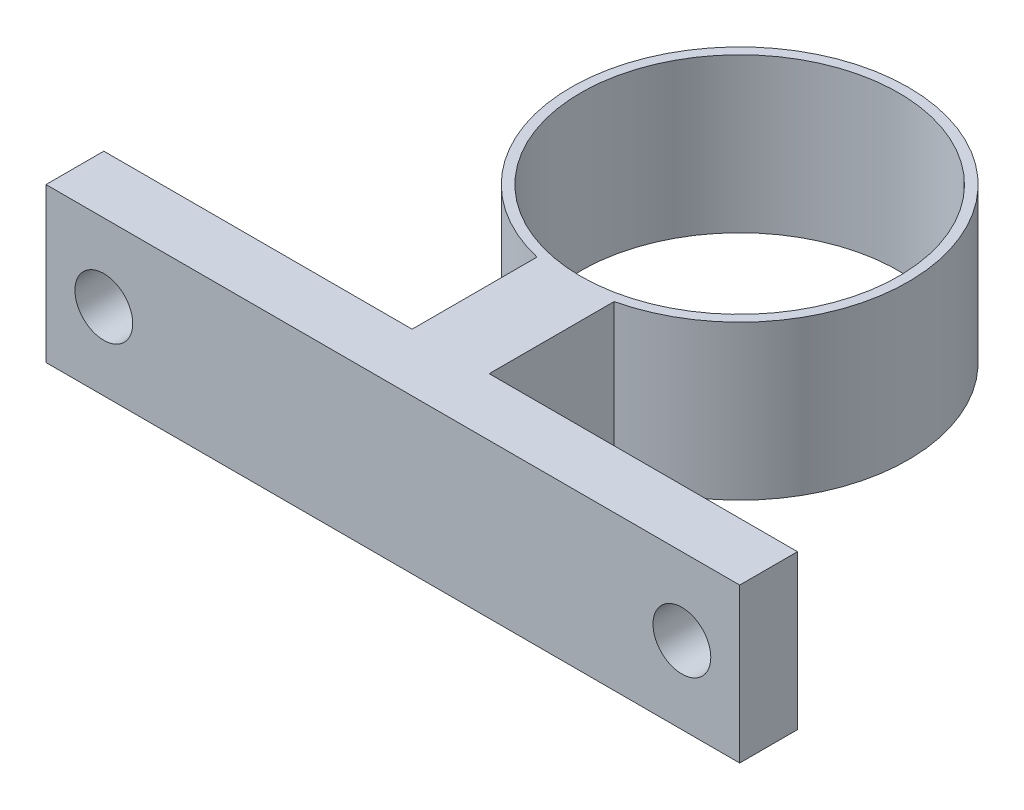
ISO-10303-21;
HEADER;
FILE_DESCRIPTION(('STEP AP214'),'2;1');
FILE_NAME('part.step','',(''),(''),'','','');
FILE_SCHEMA(('AUTOMOTIVE_DESIGN { 1 0 10303 214 1 1 1 1 }'));
ENDSEC;
DATA;
#1=APPLICATION_CONTEXT('core data for automotive mechanical design processes');
#2=APPLICATION_PROTOCOL_DEFINITION('international standard','automotive_design',2000,#1);
#3=PRODUCT_CONTEXT('',#1,'mechanical');
#4=PRODUCT('Part','Part','',(#3));
#5=PRODUCT_RELATED_PRODUCT_CATEGORY('part','',(#4));
#6=PRODUCT_DEFINITION_FORMATION('','',#4);
#7=PRODUCT_DEFINITION_CONTEXT('part definition',#1,'design');
#8=PRODUCT_DEFINITION('design','',#6,#7);
#9=PRODUCT_DEFINITION_SHAPE('','',#8);
#10=(LENGTH_UNIT() NAMED_UNIT(*) SI_UNIT(.MILLI.,.METRE.));
#11=(NAMED_UNIT(*) PLANE_ANGLE_UNIT() SI_UNIT($,.RADIAN.));
#12=(NAMED_UNIT(*) SI_UNIT($,.STERADIAN.) SOLID_ANGLE_UNIT());
#13=UNCERTAINTY_MEASURE_WITH_UNIT(LENGTH_MEASURE(1.E-05),#10,'distance_accuracy_value','');
#14=(GEOMETRIC_REPRESENTATION_CONTEXT(3) GLOBAL_UNCERTAINTY_ASSIGNED_CONTEXT((#13)) GLOBAL_UNIT_ASSIGNED_CONTEXT((#10,
#11,#12)) REPRESENTATION_CONTEXT('',''));
#15=CARTESIAN_POINT('',(0.,0.,0.));
#16=DIRECTION('',(0.,0.,1.));
#17=DIRECTION('',(1.,0.,0.));
#18=AXIS2_PLACEMENT_3D('',#15,#16,#17);
#19=CARTESIAN_POINT('',(-35.0916350243657,8.,0.));
#20=DIRECTION('',(0.,-1.,0.));
#21=DIRECTION('',(0.,0.,-1.));
#22=AXIS2_PLACEMENT_3D('',#19,#20,#21);
#23=CYLINDRICAL_SURFACE('',#22,8.75);
#24=DIRECTION('',(0.,-1.,0.));
#25=VECTOR('',#24,1.);
#26=CARTESIAN_POINT('',(-33.0916350243657,8.,8.51836251870042));
#27=LINE('',#26,#25);
#28=CARTESIAN_POINT('',(-33.0916350243657,8.,8.51836251870042));
#29=VERTEX_POINT('',#28);
#30=CARTESIAN_POINT('',(-33.0916350243657,0.,8.51836251870042));
#31=VERTEX_POINT('',#30);
#32=EDGE_CURVE('E126',#29,#31,#27,.T.);
#33=ORIENTED_EDGE('',*,*,#32,.T.);
#34=CARTESIAN_POINT('',(-35.0916350243657,0.,0.));
#35=DIRECTION('',(0.,1.,0.));
#36=DIRECTION('',(0.,0.,1.));
#37=AXIS2_PLACEMENT_3D('',#34,#35,#36);
#38=CIRCLE('',#37,8.75);
#39=CARTESIAN_POINT('',(-37.0916350243657,0.,8.51836251870042));
#40=VERTEX_POINT('',#39);
#41=EDGE_CURVE('E37',#31,#40,#38,.T.);
#42=ORIENTED_EDGE('',*,*,#41,.T.);
#43=DIRECTION('',(0.,-1.,0.));
#44=VECTOR('',#43,1.);
#45=CARTESIAN_POINT('',(-37.0916350243657,8.,8.51836251870042));
#46=LINE('',#45,#44);
#47=CARTESIAN_POINT('',(-37.0916350243657,8.,8.51836251870042));
#48=VERTEX_POINT('',#47);
#49=EDGE_CURVE('E51',#48,#40,#46,.T.);
#50=ORIENTED_EDGE('',*,*,#49,.F.);
#51=CARTESIAN_POINT('',(-35.0916350243657,8.,0.));
#52=DIRECTION('',(0.,1.,0.));
#53=DIRECTION('',(0.,0.,1.));
#54=AXIS2_PLACEMENT_3D('',#51,#52,#53);
#55=CIRCLE('',#54,8.75);
#56=EDGE_CURVE('E11',#29,#48,#55,.T.);
#57=ORIENTED_EDGE('',*,*,#56,.F.);
#58=EDGE_LOOP('',(#33,#42,#50,#57));
#59=FACE_BOUND('',#58,.T.);
#60=ADVANCED_FACE('F34',(#59),#23,.T.);
#61=CARTESIAN_POINT('',(-35.0916350243657,8.,0.));
#62=DIRECTION('',(0.,1.,0.));
#63=DIRECTION('',(0.,0.,1.));
#64=AXIS2_PLACEMENT_3D('',#61,#62,#63);
#65=PLANE('',#64);
#66=DIRECTION('',(0.,0.,-1.));
#67=VECTOR('',#66,1.);
#68=CARTESIAN_POINT('',(-33.0916350243657,8.,8.51836251870042));
#69=LINE('',#68,#67);
#70=CARTESIAN_POINT('',(-33.0916350243657,8.,15.));
#71=VERTEX_POINT('',#70);
#72=EDGE_CURVE('E105',#71,#29,#69,.T.);
#73=ORIENTED_EDGE('',*,*,#72,.T.);
#74=ORIENTED_EDGE('',*,*,#56,.T.);
#75=DIRECTION('',(0.,0.,1.));
#76=VECTOR('',#75,1.);
#77=CARTESIAN_POINT('',(-37.0916350243657,8.,15.));
#78=LINE('',#77,#76);
#79=CARTESIAN_POINT('',(-37.0916350243657,8.,15.));
#80=VERTEX_POINT('',#79);
#81=EDGE_CURVE('E197',#48,#80,#78,.T.);
#82=ORIENTED_EDGE('',*,*,#81,.T.);
#83=DIRECTION('',(-1.,0.,0.));
#84=VECTOR('',#83,1.);
#85=CARTESIAN_POINT('',(-53.0916350243657,8.,15.));
#86=LINE('',#85,#84);
#87=CARTESIAN_POINT('',(-53.0916350243657,8.,15.));
#88=VERTEX_POINT('',#87);
#89=EDGE_CURVE('E199',#80,#88,#86,.T.);
#90=ORIENTED_EDGE('',*,*,#89,.T.);
#91=DIRECTION('',(0.,0.,1.));
#92=VECTOR('',#91,1.);
#93=CARTESIAN_POINT('',(-53.0916350243657,8.,18.));
#94=LINE('',#93,#92);
#95=CARTESIAN_POINT('',(-53.0916350243657,8.,18.));
#96=VERTEX_POINT('',#95);
#97=EDGE_CURVE('E201',#88,#96,#94,.T.);
#98=ORIENTED_EDGE('',*,*,#97,.T.);
#99=DIRECTION('',(1.,0.,0.));
#100=VECTOR('',#99,1.);
#101=CARTESIAN_POINT('',(-17.0916350243657,8.,18.));
#102=LINE('',#101,#100);
#103=CARTESIAN_POINT('',(-17.0916350243657,8.,18.));
#104=VERTEX_POINT('',#103);
#105=EDGE_CURVE('E112',#96,#104,#102,.T.);
#106=ORIENTED_EDGE('',*,*,#105,.T.);
#107=DIRECTION('',(0.,0.,-1.));
#108=VECTOR('',#107,1.);
#109=CARTESIAN_POINT('',(-17.0916350243657,8.,15.));
#110=LINE('',#109,#108);
#111=CARTESIAN_POINT('',(-17.0916350243657,8.,15.));
#112=VERTEX_POINT('',#111);
#113=EDGE_CURVE('E106',#104,#112,#110,.T.);
#114=ORIENTED_EDGE('',*,*,#113,.T.);
#115=DIRECTION('',(-1.,0.,0.));
#116=VECTOR('',#115,1.);
#117=CARTESIAN_POINT('',(-33.0916350243657,8.,15.));
#118=LINE('',#117,#116);
#119=EDGE_CURVE('E94',#112,#71,#118,.T.);
#120=ORIENTED_EDGE('',*,*,#119,.T.);
#121=EDGE_LOOP('',(#73,#74,#82,#90,#98,#106,#114,#120));
#122=FACE_BOUND('',#121,.T.);
#123=CARTESIAN_POINT('',(-35.0916350243657,8.,0.));
#124=DIRECTION('',(0.,1.,0.));
#125=DIRECTION('',(0.,0.,1.));
#126=AXIS2_PLACEMENT_3D('',#123,#124,#125);
#127=CIRCLE('',#126,8.25);
#128=CARTESIAN_POINT('',(-35.0916350243657,8.,8.25));
#129=VERTEX_POINT('',#128);
#130=EDGE_CURVE('E124',#129,#129,#127,.T.);
#131=ORIENTED_EDGE('',*,*,#130,.F.);
#132=EDGE_LOOP('',(#131));
#133=FACE_BOUND('',#132,.T.);
#134=ADVANCED_FACE('F109',(#122,#133),#65,.T.);
#135=CARTESIAN_POINT('',(-35.0916350243657,0.,0.));
#136=DIRECTION('',(0.,1.,0.));
#137=DIRECTION('',(0.,0.,1.));
#138=AXIS2_PLACEMENT_3D('',#135,#136,#137);
#139=PLANE('',#138);
#140=DIRECTION('',(0.,0.,1.));
#141=VECTOR('',#140,1.);
#142=CARTESIAN_POINT('',(-37.0916350243657,0.,15.));
#143=LINE('',#142,#141);
#144=CARTESIAN_POINT('',(-37.0916350243657,0.,15.));
#145=VERTEX_POINT('',#144);
#146=EDGE_CURVE('E211',#40,#145,#143,.T.);
#147=ORIENTED_EDGE('',*,*,#146,.F.);
#148=ORIENTED_EDGE('',*,*,#41,.F.);
#149=DIRECTION('',(0.,0.,-1.));
#150=VECTOR('',#149,1.);
#151=CARTESIAN_POINT('',(-33.0916350243657,0.,8.51836251870042));
#152=LINE('',#151,#150);
#153=CARTESIAN_POINT('',(-33.0916350243657,0.,15.));
#154=VERTEX_POINT('',#153);
#155=EDGE_CURVE('E208',#154,#31,#152,.T.);
#156=ORIENTED_EDGE('',*,*,#155,.F.);
#157=DIRECTION('',(-1.,0.,0.));
#158=VECTOR('',#157,1.);
#159=CARTESIAN_POINT('',(-33.0916350243657,0.,15.));
#160=LINE('',#159,#158);
#161=CARTESIAN_POINT('',(-17.0916350243657,0.,15.));
#162=VERTEX_POINT('',#161);
#163=EDGE_CURVE('E206',#162,#154,#160,.T.);
#164=ORIENTED_EDGE('',*,*,#163,.F.);
#165=DIRECTION('',(0.,0.,-1.));
#166=VECTOR('',#165,1.);
#167=CARTESIAN_POINT('',(-17.0916350243657,0.,15.));
#168=LINE('',#167,#166);
#169=CARTESIAN_POINT('',(-17.0916350243657,0.,18.));
#170=VERTEX_POINT('',#169);
#171=EDGE_CURVE('E120',#170,#162,#168,.T.);
#172=ORIENTED_EDGE('',*,*,#171,.F.);
#173=DIRECTION('',(1.,0.,0.));
#174=VECTOR('',#173,1.);
#175=CARTESIAN_POINT('',(-17.0916350243657,0.,18.));
#176=LINE('',#175,#174);
#177=CARTESIAN_POINT('',(-53.0916350243657,0.,18.));
#178=VERTEX_POINT('',#177);
#179=EDGE_CURVE('E116',#178,#170,#176,.T.);
#180=ORIENTED_EDGE('',*,*,#179,.F.);
#181=DIRECTION('',(0.,0.,1.));
#182=VECTOR('',#181,1.);
#183=CARTESIAN_POINT('',(-53.0916350243657,0.,18.));
#184=LINE('',#183,#182);
#185=CARTESIAN_POINT('',(-53.0916350243657,0.,15.));
#186=VERTEX_POINT('',#185);
#187=EDGE_CURVE('E215',#186,#178,#184,.T.);
#188=ORIENTED_EDGE('',*,*,#187,.F.);
#189=DIRECTION('',(-1.,0.,0.));
#190=VECTOR('',#189,1.);
#191=CARTESIAN_POINT('',(-53.0916350243657,0.,15.));
#192=LINE('',#191,#190);
#193=EDGE_CURVE('E213',#145,#186,#192,.T.);
#194=ORIENTED_EDGE('',*,*,#193,.F.);
#195=EDGE_LOOP('',(#147,#148,#156,#164,#172,#180,#188,#194));
#196=FACE_BOUND('',#195,.T.);
#197=CARTESIAN_POINT('',(-35.0916350243657,0.,0.));
#198=DIRECTION('',(0.,1.,0.));
#199=DIRECTION('',(0.,0.,1.));
#200=AXIS2_PLACEMENT_3D('',#197,#198,#199);
#201=CIRCLE('',#200,8.25);
#202=CARTESIAN_POINT('',(-35.0916350243657,0.,8.25));
#203=VERTEX_POINT('',#202);
#204=EDGE_CURVE('E121',#203,#203,#201,.T.);
#205=ORIENTED_EDGE('',*,*,#204,.T.);
#206=EDGE_LOOP('',(#205));
#207=FACE_BOUND('',#206,.T.);
#208=ADVANCED_FACE('F136',(#196,#207),#139,.F.);
#209=CARTESIAN_POINT('',(-35.0916350243657,8.,0.));
#210=DIRECTION('',(0.,-1.,0.));
#211=DIRECTION('',(0.,0.,-1.));
#212=AXIS2_PLACEMENT_3D('',#209,#210,#211);
#213=CYLINDRICAL_SURFACE('',#212,8.25);
#214=ORIENTED_EDGE('',*,*,#130,.T.);
#215=EDGE_LOOP('',(#214));
#216=FACE_BOUND('',#215,.T.);
#217=ORIENTED_EDGE('',*,*,#204,.F.);
#218=EDGE_LOOP('',(#217));
#219=FACE_BOUND('',#218,.T.);
#220=ADVANCED_FACE('F133',(#216,#219),#213,.F.);
#221=CARTESIAN_POINT('',(-17.0916350243657,8.,15.));
#222=DIRECTION('',(-1.,0.,0.));
#223=DIRECTION('',(0.,0.,1.));
#224=AXIS2_PLACEMENT_3D('',#221,#222,#223);
#225=PLANE('',#224);
#226=ORIENTED_EDGE('',*,*,#171,.T.);
#227=DIRECTION('',(0.,-1.,0.));
#228=VECTOR('',#227,1.);
#229=CARTESIAN_POINT('',(-17.0916350243657,8.,15.));
#230=LINE('',#229,#228);
#231=EDGE_CURVE('E98',#112,#162,#230,.T.);
#232=ORIENTED_EDGE('',*,*,#231,.F.);
#233=ORIENTED_EDGE('',*,*,#113,.F.);
#234=DIRECTION('',(0.,-1.,0.));
#235=VECTOR('',#234,1.);
#236=CARTESIAN_POINT('',(-17.0916350243657,8.,18.));
#237=LINE('',#236,#235);
#238=EDGE_CURVE('E204',#104,#170,#237,.T.);
#239=ORIENTED_EDGE('',*,*,#238,.T.);
#240=EDGE_LOOP('',(#226,#232,#233,#239));
#241=FACE_BOUND('',#240,.T.);
#242=ADVANCED_FACE('F118',(#241),#225,.F.);
#243=CARTESIAN_POINT('',(-33.0916350243657,8.,15.));
#244=DIRECTION('',(0.,0.,1.));
#245=DIRECTION('',(1.,0.,0.));
#246=AXIS2_PLACEMENT_3D('',#243,#244,#245);
#247=PLANE('',#246);
#248=CARTESIAN_POINT('',(-20.0916350243657,4.,15.));
#249=DIRECTION('',(0.,0.,1.));
#250=DIRECTION('',(1.,0.,0.));
#251=AXIS2_PLACEMENT_3D('',#248,#249,#250);
#252=CIRCLE('',#251,1.5);
#253=CARTESIAN_POINT('',(-18.5916350243657,4.,15.));
#254=VERTEX_POINT('',#253);
#255=EDGE_CURVE('E186',#254,#254,#252,.T.);
#256=ORIENTED_EDGE('',*,*,#255,.T.);
#257=EDGE_LOOP('',(#256));
#258=FACE_BOUND('',#257,.T.);
#259=ORIENTED_EDGE('',*,*,#163,.T.);
#260=DIRECTION('',(0.,-1.,0.));
#261=VECTOR('',#260,1.);
#262=CARTESIAN_POINT('',(-33.0916350243657,8.,15.));
#263=LINE('',#262,#261);
#264=EDGE_CURVE('E101',#71,#154,#263,.T.);
#265=ORIENTED_EDGE('',*,*,#264,.F.);
#266=ORIENTED_EDGE('',*,*,#119,.F.);
#267=ORIENTED_EDGE('',*,*,#231,.T.);
#268=EDGE_LOOP('',(#259,#265,#266,#267));
#269=FACE_BOUND('',#268,.T.);
#270=ADVANCED_FACE('F96',(#258,#269),#247,.F.);
#271=CARTESIAN_POINT('',(-33.0916350243657,8.,8.51836251870042));
#272=DIRECTION('',(-1.,0.,0.));
#273=DIRECTION('',(0.,0.,1.));
#274=AXIS2_PLACEMENT_3D('',#271,#272,#273);
#275=PLANE('',#274);
#276=ORIENTED_EDGE('',*,*,#155,.T.);
#277=ORIENTED_EDGE('',*,*,#32,.F.);
#278=ORIENTED_EDGE('',*,*,#72,.F.);
#279=ORIENTED_EDGE('',*,*,#264,.T.);
#280=EDGE_LOOP('',(#276,#277,#278,#279));
#281=FACE_BOUND('',#280,.T.);
#282=ADVANCED_FACE('F150',(#281),#275,.F.);
#283=CARTESIAN_POINT('',(-37.0916350243657,8.,15.));
#284=DIRECTION('',(1.,0.,0.));
#285=DIRECTION('',(0.,0.,-1.));
#286=AXIS2_PLACEMENT_3D('',#283,#284,#285);
#287=PLANE('',#286);
#288=ORIENTED_EDGE('',*,*,#146,.T.);
#289=DIRECTION('',(0.,-1.,0.));
#290=VECTOR('',#289,1.);
#291=CARTESIAN_POINT('',(-37.0916350243657,8.,15.));
#292=LINE('',#291,#290);
#293=EDGE_CURVE('E225',#80,#145,#292,.T.);
#294=ORIENTED_EDGE('',*,*,#293,.F.);
#295=ORIENTED_EDGE('',*,*,#81,.F.);
#296=ORIENTED_EDGE('',*,*,#49,.T.);
#297=EDGE_LOOP('',(#288,#294,#295,#296));
#298=FACE_BOUND('',#297,.T.);
#299=ADVANCED_FACE('F154',(#298),#287,.F.);
#300=CARTESIAN_POINT('',(-53.0916350243657,8.,15.));
#301=DIRECTION('',(0.,0.,1.));
#302=DIRECTION('',(1.,0.,0.));
#303=AXIS2_PLACEMENT_3D('',#300,#301,#302);
#304=PLANE('',#303);
#305=CARTESIAN_POINT('',(-50.0916350243657,4.,15.));
#306=DIRECTION('',(0.,0.,1.));
#307=DIRECTION('',(1.,0.,0.));
#308=AXIS2_PLACEMENT_3D('',#305,#306,#307);
#309=CIRCLE('',#308,1.5);
#310=CARTESIAN_POINT('',(-48.5916350243657,4.,15.));
#311=VERTEX_POINT('',#310);
#312=EDGE_CURVE('E190',#311,#311,#309,.T.);
#313=ORIENTED_EDGE('',*,*,#312,.T.);
#314=EDGE_LOOP('',(#313));
#315=FACE_BOUND('',#314,.T.);
#316=ORIENTED_EDGE('',*,*,#193,.T.);
#317=DIRECTION('',(0.,-1.,0.));
#318=VECTOR('',#317,1.);
#319=CARTESIAN_POINT('',(-53.0916350243657,8.,15.));
#320=LINE('',#319,#318);
#321=EDGE_CURVE('E222',#88,#186,#320,.T.);
#322=ORIENTED_EDGE('',*,*,#321,.F.);
#323=ORIENTED_EDGE('',*,*,#89,.F.);
#324=ORIENTED_EDGE('',*,*,#293,.T.);
#325=EDGE_LOOP('',(#316,#322,#323,#324));
#326=FACE_BOUND('',#325,.T.);
#327=ADVANCED_FACE('F158',(#315,#326),#304,.F.);
#328=CARTESIAN_POINT('',(-53.0916350243657,8.,18.));
#329=DIRECTION('',(1.,0.,0.));
#330=DIRECTION('',(0.,0.,-1.));
#331=AXIS2_PLACEMENT_3D('',#328,#329,#330);
#332=PLANE('',#331);
#333=ORIENTED_EDGE('',*,*,#187,.T.);
#334=DIRECTION('',(0.,-1.,0.));
#335=VECTOR('',#334,1.);
#336=CARTESIAN_POINT('',(-53.0916350243657,8.,18.));
#337=LINE('',#336,#335);
#338=EDGE_CURVE('E219',#96,#178,#337,.T.);
#339=ORIENTED_EDGE('',*,*,#338,.F.);
#340=ORIENTED_EDGE('',*,*,#97,.F.);
#341=ORIENTED_EDGE('',*,*,#321,.T.);
#342=EDGE_LOOP('',(#333,#339,#340,#341));
#343=FACE_BOUND('',#342,.T.);
#344=ADVANCED_FACE('F162',(#343),#332,.F.);
#345=CARTESIAN_POINT('',(-17.0916350243657,8.,18.));
#346=DIRECTION('',(0.,0.,-1.));
#347=DIRECTION('',(-1.,0.,0.));
#348=AXIS2_PLACEMENT_3D('',#345,#346,#347);
#349=PLANE('',#348);
#350=CARTESIAN_POINT('',(-20.0916350243657,4.,18.));
#351=DIRECTION('',(0.,0.,1.));
#352=DIRECTION('',(1.,0.,0.));
#353=AXIS2_PLACEMENT_3D('',#350,#351,#352);
#354=CIRCLE('',#353,1.5);
#355=CARTESIAN_POINT('',(-18.5916350243657,4.,18.));
#356=VERTEX_POINT('',#355);
#357=EDGE_CURVE('E183',#356,#356,#354,.T.);
#358=ORIENTED_EDGE('',*,*,#357,.F.);
#359=EDGE_LOOP('',(#358));
#360=FACE_BOUND('',#359,.T.);
#361=CARTESIAN_POINT('',(-50.0916350243657,4.,18.));
#362=DIRECTION('',(0.,0.,1.));
#363=DIRECTION('',(1.,0.,0.));
#364=AXIS2_PLACEMENT_3D('',#361,#362,#363);
#365=CIRCLE('',#364,1.5);
#366=CARTESIAN_POINT('',(-48.5916350243657,4.,18.));
#367=VERTEX_POINT('',#366);
#368=EDGE_CURVE('E187',#367,#367,#365,.T.);
#369=ORIENTED_EDGE('',*,*,#368,.F.);
#370=EDGE_LOOP('',(#369));
#371=FACE_BOUND('',#370,.T.);
#372=ORIENTED_EDGE('',*,*,#179,.T.);
#373=ORIENTED_EDGE('',*,*,#238,.F.);
#374=ORIENTED_EDGE('',*,*,#105,.F.);
#375=ORIENTED_EDGE('',*,*,#338,.T.);
#376=EDGE_LOOP('',(#372,#373,#374,#375));
#377=FACE_BOUND('',#376,.T.);
#378=ADVANCED_FACE('F166',(#360,#371,#377),#349,.F.);
#379=CARTESIAN_POINT('',(-50.0916350243657,4.,10.));
#380=DIRECTION('',(0.,0.,1.));
#381=DIRECTION('',(1.,0.,0.));
#382=AXIS2_PLACEMENT_3D('',#379,#380,#381);
#383=CYLINDRICAL_SURFACE('',#382,1.5);
#384=ORIENTED_EDGE('',*,*,#368,.T.);
#385=EDGE_LOOP('',(#384));
#386=FACE_BOUND('',#385,.T.);
#387=ORIENTED_EDGE('',*,*,#312,.F.);
#388=EDGE_LOOP('',(#387));
#389=FACE_BOUND('',#388,.T.);
#390=ADVANCED_FACE('F170',(#386,#389),#383,.F.);
#391=CARTESIAN_POINT('',(-20.0916350243657,4.,10.));
#392=DIRECTION('',(0.,0.,1.));
#393=DIRECTION('',(1.,0.,0.));
#394=AXIS2_PLACEMENT_3D('',#391,#392,#393);
#395=CYLINDRICAL_SURFACE('',#394,1.5);
#396=ORIENTED_EDGE('',*,*,#357,.T.);
#397=EDGE_LOOP('',(#396));
#398=FACE_BOUND('',#397,.T.);
#399=ORIENTED_EDGE('',*,*,#255,.F.);
#400=EDGE_LOOP('',(#399));
#401=FACE_BOUND('',#400,.T.);
#402=ADVANCED_FACE('F174',(#398,#401),#395,.F.);
#403=CLOSED_SHELL('',(#60,#134,#208,#220,#242,#270,#282,#299,#327,#344,#378,#390,#402));
#404=MANIFOLD_SOLID_BREP('B2',#403);
#405=ADVANCED_BREP_SHAPE_REPRESENTATION('',(#18,#404),#14);
#406=SHAPE_DEFINITION_REPRESENTATION(#9,#405);
ENDSEC;
END-ISO-10303-21;
